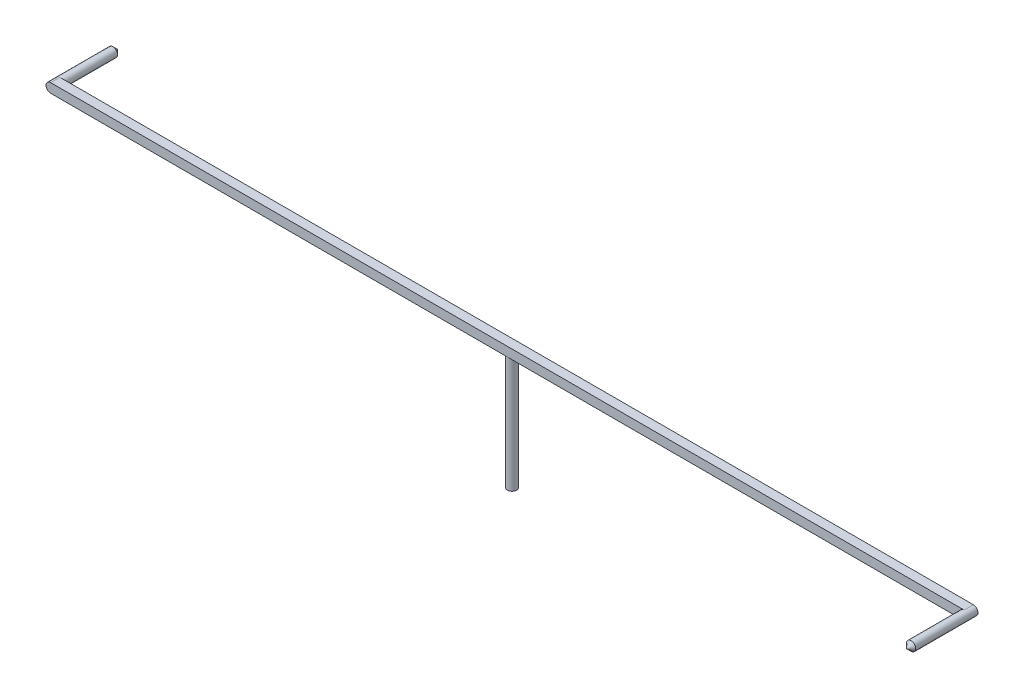
ISO-10303-21;
HEADER;
FILE_DESCRIPTION(('STEP AP214'),'2;1');
FILE_NAME('part.step','',(''),(''),'','','');
FILE_SCHEMA(('AUTOMOTIVE_DESIGN { 1 0 10303 214 1 1 1 1 }'));
ENDSEC;
DATA;
#1=APPLICATION_CONTEXT('core data for automotive mechanical design processes');
#2=APPLICATION_PROTOCOL_DEFINITION('international standard','automotive_design',2000,#1);
#3=PRODUCT_CONTEXT('',#1,'mechanical');
#4=PRODUCT('Part','Part','',(#3));
#5=PRODUCT_RELATED_PRODUCT_CATEGORY('part','',(#4));
#6=PRODUCT_DEFINITION_FORMATION('','',#4);
#7=PRODUCT_DEFINITION_CONTEXT('part definition',#1,'design');
#8=PRODUCT_DEFINITION('design','',#6,#7);
#9=PRODUCT_DEFINITION_SHAPE('','',#8);
#10=(LENGTH_UNIT() NAMED_UNIT(*) SI_UNIT(.MILLI.,.METRE.));
#11=(NAMED_UNIT(*) PLANE_ANGLE_UNIT() SI_UNIT($,.RADIAN.));
#12=(NAMED_UNIT(*) SI_UNIT($,.STERADIAN.) SOLID_ANGLE_UNIT());
#13=UNCERTAINTY_MEASURE_WITH_UNIT(LENGTH_MEASURE(1.E-05),#10,'distance_accuracy_value','');
#14=(GEOMETRIC_REPRESENTATION_CONTEXT(3) GLOBAL_UNCERTAINTY_ASSIGNED_CONTEXT((#13)) GLOBAL_UNIT_ASSIGNED_CONTEXT((#10,
#11,#12)) REPRESENTATION_CONTEXT('',''));
#15=CARTESIAN_POINT('',(0.,0.,0.));
#16=DIRECTION('',(0.,0.,1.));
#17=DIRECTION('',(1.,0.,0.));
#18=AXIS2_PLACEMENT_3D('',#15,#16,#17);
#19=CARTESIAN_POINT('',(0.,10.,0.));
#20=DIRECTION('',(0.,-1.,0.));
#21=DIRECTION('',(0.,0.,-1.));
#22=AXIS2_PLACEMENT_3D('',#19,#20,#21);
#23=CYLINDRICAL_SURFACE('',#22,0.4);
#24=CARTESIAN_POINT('',(0.,10.,0.));
#25=DIRECTION('',(0.,1.,0.));
#26=DIRECTION('',(0.,0.,1.));
#27=AXIS2_PLACEMENT_3D('',#24,#25,#26);
#28=CIRCLE('',#27,0.4);
#29=CARTESIAN_POINT('',(0.,10.,0.4));
#30=VERTEX_POINT('',#29);
#31=CARTESIAN_POINT('',(0.,10.,-0.4));
#32=VERTEX_POINT('',#31);
#33=EDGE_CURVE('E164',#30,#32,#28,.T.);
#34=ORIENTED_EDGE('',*,*,#33,.F.);
#35=EDGE_CURVE('E167',#32,#30,#28,.T.);
#36=ORIENTED_EDGE('',*,*,#35,.F.);
#37=EDGE_LOOP('',(#34,#36));
#38=FACE_BOUND('',#37,.T.);
#39=CARTESIAN_POINT('',(0.,0.,0.));
#40=DIRECTION('',(0.,1.,0.));
#41=DIRECTION('',(0.,0.,1.));
#42=AXIS2_PLACEMENT_3D('',#39,#40,#41);
#43=CIRCLE('',#42,0.4);
#44=CARTESIAN_POINT('',(0.,0.,0.4));
#45=VERTEX_POINT('',#44);
#46=EDGE_CURVE('E153',#45,#45,#43,.T.);
#47=ORIENTED_EDGE('',*,*,#46,.T.);
#48=EDGE_LOOP('',(#47));
#49=FACE_BOUND('',#48,.T.);
#50=ADVANCED_FACE('F35',(#38,#49),#23,.T.);
#51=CARTESIAN_POINT('',(0.,0.,0.));
#52=DIRECTION('',(0.,1.,0.));
#53=DIRECTION('',(0.,0.,1.));
#54=AXIS2_PLACEMENT_3D('',#51,#52,#53);
#55=PLANE('',#54);
#56=ORIENTED_EDGE('',*,*,#46,.F.);
#57=EDGE_LOOP('',(#56));
#58=FACE_BOUND('',#57,.T.);
#59=ADVANCED_FACE('F77',(#58),#55,.F.);
#60=CARTESIAN_POINT('',(0.,10.,0.));
#61=DIRECTION('',(0.,1.,0.));
#62=DIRECTION('',(0.,0.,1.));
#63=AXIS2_PLACEMENT_3D('',#60,#61,#62);
#64=PLANE('',#63);
#65=DIRECTION('',(-1.,0.,0.));
#66=VECTOR('',#65,1.);
#67=CARTESIAN_POINT('',(-40.,10.,-0.4));
#68=LINE('',#67,#66);
#69=CARTESIAN_POINT('',(39.6,10.,-0.4));
#70=VERTEX_POINT('',#69);
#71=EDGE_CURVE('E151',#70,#32,#68,.T.);
#72=ORIENTED_EDGE('',*,*,#71,.F.);
#73=DIRECTION('',(0.,0.,-1.));
#74=VECTOR('',#73,1.);
#75=CARTESIAN_POINT('',(39.6,10.,0.));
#76=LINE('',#75,#74);
#77=CARTESIAN_POINT('',(39.6,10.,0.4));
#78=VERTEX_POINT('',#77);
#79=EDGE_CURVE('E119',#70,#78,#76,.F.);
#80=ORIENTED_EDGE('',*,*,#79,.T.);
#81=DIRECTION('',(1.,0.,0.));
#82=VECTOR('',#81,1.);
#83=CARTESIAN_POINT('',(-40.,10.,0.4));
#84=LINE('',#83,#82);
#85=EDGE_CURVE('E128',#30,#78,#84,.T.);
#86=ORIENTED_EDGE('',*,*,#85,.F.);
#87=ORIENTED_EDGE('',*,*,#33,.T.);
#88=EDGE_LOOP('',(#72,#80,#86,#87));
#89=FACE_BOUND('',#88,.T.);
#90=ADVANCED_FACE('F83',(#89),#64,.F.);
#91=CARTESIAN_POINT('',(-39.6,10.,0.4));
#92=VERTEX_POINT('',#91);
#93=EDGE_CURVE('E161',#92,#30,#84,.T.);
#94=ORIENTED_EDGE('',*,*,#93,.F.);
#95=DIRECTION('',(0.,0.,1.));
#96=VECTOR('',#95,1.);
#97=CARTESIAN_POINT('',(-39.6,10.,0.));
#98=LINE('',#97,#96);
#99=CARTESIAN_POINT('',(-39.6,10.,-0.4));
#100=VERTEX_POINT('',#99);
#101=EDGE_CURVE('E173',#92,#100,#98,.F.);
#102=ORIENTED_EDGE('',*,*,#101,.T.);
#103=EDGE_CURVE('E156',#32,#100,#68,.T.);
#104=ORIENTED_EDGE('',*,*,#103,.F.);
#105=ORIENTED_EDGE('',*,*,#35,.T.);
#106=EDGE_LOOP('',(#94,#102,#104,#105));
#107=FACE_BOUND('',#106,.T.);
#108=ADVANCED_FACE('F179',(#107),#64,.F.);
#109=CARTESIAN_POINT('',(-40.,10.8,0.4));
#110=DIRECTION('',(0.,0.,-1.));
#111=DIRECTION('',(-1.,0.,0.));
#112=AXIS2_PLACEMENT_3D('',#109,#110,#111);
#113=PLANE('',#112);
#114=CARTESIAN_POINT('',(39.6,10.4,0.4));
#115=DIRECTION('',(0.,0.,1.));
#116=DIRECTION('',(1.,0.,0.));
#117=AXIS2_PLACEMENT_3D('',#114,#115,#116);
#118=CIRCLE('',#117,0.399999999999998);
#119=CARTESIAN_POINT('',(39.6,10.8,0.4));
#120=VERTEX_POINT('',#119);
#121=EDGE_CURVE('E108',#120,#78,#118,.T.);
#122=ORIENTED_EDGE('',*,*,#121,.F.);
#123=DIRECTION('',(1.,0.,0.));
#124=VECTOR('',#123,1.);
#125=CARTESIAN_POINT('',(-40.,10.8,0.4));
#126=LINE('',#125,#124);
#127=CARTESIAN_POINT('',(-39.6,10.8,0.4));
#128=VERTEX_POINT('',#127);
#129=EDGE_CURVE('E144',#128,#120,#126,.T.);
#130=ORIENTED_EDGE('',*,*,#129,.F.);
#131=CARTESIAN_POINT('',(-39.6,10.4,0.4));
#132=DIRECTION('',(0.,0.,-1.));
#133=DIRECTION('',(-1.,0.,0.));
#134=AXIS2_PLACEMENT_3D('',#131,#132,#133);
#135=CIRCLE('',#134,0.4);
#136=CARTESIAN_POINT('',(-40.,10.4,0.4));
#137=VERTEX_POINT('',#136);
#138=EDGE_CURVE('E142',#128,#137,#135,.F.);
#139=ORIENTED_EDGE('',*,*,#138,.T.);
#140=CARTESIAN_POINT('',(-39.6,10.4,0.4));
#141=DIRECTION('',(0.,0.,-1.));
#142=DIRECTION('',(-1.,0.,0.));
#143=AXIS2_PLACEMENT_3D('',#140,#141,#142);
#144=CIRCLE('',#143,0.4);
#145=EDGE_CURVE('E171',#137,#92,#144,.F.);
#146=ORIENTED_EDGE('',*,*,#145,.T.);
#147=ORIENTED_EDGE('',*,*,#93,.T.);
#148=ORIENTED_EDGE('',*,*,#85,.T.);
#149=EDGE_LOOP('',(#122,#130,#139,#146,#147,#148));
#150=FACE_BOUND('',#149,.T.);
#151=ADVANCED_FACE('F148',(#150),#113,.F.);
#152=CARTESIAN_POINT('',(-40.,10.8,-0.4));
#153=DIRECTION('',(0.,0.,1.));
#154=DIRECTION('',(1.,0.,0.));
#155=AXIS2_PLACEMENT_3D('',#152,#153,#154);
#156=PLANE('',#155);
#157=CARTESIAN_POINT('',(-39.6,10.4,-0.4));
#158=DIRECTION('',(0.,0.,-1.));
#159=DIRECTION('',(-1.,0.,0.));
#160=AXIS2_PLACEMENT_3D('',#157,#158,#159);
#161=CIRCLE('',#160,0.399999999999998);
#162=CARTESIAN_POINT('',(-39.6,10.8,-0.4));
#163=VERTEX_POINT('',#162);
#164=EDGE_CURVE('E139',#163,#100,#161,.T.);
#165=ORIENTED_EDGE('',*,*,#164,.F.);
#166=DIRECTION('',(-1.,0.,0.));
#167=VECTOR('',#166,1.);
#168=CARTESIAN_POINT('',(-40.,10.8,-0.4));
#169=LINE('',#168,#167);
#170=CARTESIAN_POINT('',(39.6,10.8,-0.4));
#171=VERTEX_POINT('',#170);
#172=EDGE_CURVE('E145',#171,#163,#169,.T.);
#173=ORIENTED_EDGE('',*,*,#172,.F.);
#174=CARTESIAN_POINT('',(39.6,10.4,-0.4));
#175=DIRECTION('',(0.,0.,1.));
#176=DIRECTION('',(1.,0.,0.));
#177=AXIS2_PLACEMENT_3D('',#174,#175,#176);
#178=CIRCLE('',#177,0.4);
#179=CARTESIAN_POINT('',(40.,10.4,-0.4));
#180=VERTEX_POINT('',#179);
#181=EDGE_CURVE('E52',#171,#180,#178,.F.);
#182=ORIENTED_EDGE('',*,*,#181,.T.);
#183=CARTESIAN_POINT('',(39.6,10.4,-0.4));
#184=DIRECTION('',(0.,0.,1.));
#185=DIRECTION('',(1.,0.,0.));
#186=AXIS2_PLACEMENT_3D('',#183,#184,#185);
#187=CIRCLE('',#186,0.4);
#188=EDGE_CURVE('E116',#180,#70,#187,.F.);
#189=ORIENTED_EDGE('',*,*,#188,.T.);
#190=ORIENTED_EDGE('',*,*,#71,.T.);
#191=ORIENTED_EDGE('',*,*,#103,.T.);
#192=EDGE_LOOP('',(#165,#173,#182,#189,#190,#191));
#193=FACE_BOUND('',#192,.T.);
#194=ADVANCED_FACE('F186',(#193),#156,.F.);
#195=CARTESIAN_POINT('',(0.,10.8,0.));
#196=DIRECTION('',(0.,1.,0.));
#197=DIRECTION('',(0.,0.,1.));
#198=AXIS2_PLACEMENT_3D('',#195,#196,#197);
#199=PLANE('',#198);
#200=ORIENTED_EDGE('',*,*,#172,.T.);
#201=DIRECTION('',(0.,0.,1.));
#202=VECTOR('',#201,1.);
#203=CARTESIAN_POINT('',(-39.6,10.8,0.4));
#204=LINE('',#203,#202);
#205=EDGE_CURVE('E115',#163,#128,#204,.T.);
#206=ORIENTED_EDGE('',*,*,#205,.T.);
#207=ORIENTED_EDGE('',*,*,#129,.T.);
#208=DIRECTION('',(0.,0.,-1.));
#209=VECTOR('',#208,1.);
#210=CARTESIAN_POINT('',(39.6,10.8,-0.4));
#211=LINE('',#210,#209);
#212=EDGE_CURVE('E104',#120,#171,#211,.T.);
#213=ORIENTED_EDGE('',*,*,#212,.T.);
#214=EDGE_LOOP('',(#200,#206,#207,#213));
#215=FACE_BOUND('',#214,.T.);
#216=ADVANCED_FACE('F93',(#215),#199,.T.);
#217=CARTESIAN_POINT('',(-39.6,10.4,0.));
#218=DIRECTION('',(0.,0.,-1.));
#219=DIRECTION('',(-1.,0.,0.));
#220=AXIS2_PLACEMENT_3D('',#217,#218,#219);
#221=CYLINDRICAL_SURFACE('',#220,0.4);
#222=CARTESIAN_POINT('',(-39.6,10.4,-4.99999999999999));
#223=DIRECTION('',(0.,0.,-1.));
#224=DIRECTION('',(-1.,0.,0.));
#225=AXIS2_PLACEMENT_3D('',#222,#223,#224);
#226=CIRCLE('',#225,0.4);
#227=CARTESIAN_POINT('',(-40.,10.4,-4.99999999999999));
#228=VERTEX_POINT('',#227);
#229=EDGE_CURVE('E44',#228,#228,#226,.F.);
#230=ORIENTED_EDGE('',*,*,#229,.T.);
#231=EDGE_LOOP('',(#230));
#232=FACE_BOUND('',#231,.T.);
#233=ORIENTED_EDGE('',*,*,#205,.F.);
#234=ORIENTED_EDGE('',*,*,#164,.T.);
#235=ORIENTED_EDGE('',*,*,#101,.F.);
#236=ORIENTED_EDGE('',*,*,#145,.F.);
#237=DIRECTION('',(0.,0.,1.));
#238=VECTOR('',#237,1.);
#239=CARTESIAN_POINT('',(-40.,10.4,-0.4));
#240=LINE('',#239,#238);
#241=CARTESIAN_POINT('',(-40.,10.4,-0.4));
#242=VERTEX_POINT('',#241);
#243=EDGE_CURVE('E126',#137,#242,#240,.F.);
#244=ORIENTED_EDGE('',*,*,#243,.T.);
#245=ORIENTED_EDGE('',*,*,#243,.F.);
#246=ORIENTED_EDGE('',*,*,#138,.F.);
#247=EDGE_LOOP('',(#233,#234,#235,#236,#244,#245,#246));
#248=FACE_BOUND('',#247,.T.);
#249=ADVANCED_FACE('F90',(#232,#248),#221,.T.);
#250=CARTESIAN_POINT('',(39.6,10.4,0.));
#251=DIRECTION('',(0.,0.,1.));
#252=DIRECTION('',(1.,0.,0.));
#253=AXIS2_PLACEMENT_3D('',#250,#251,#252);
#254=CYLINDRICAL_SURFACE('',#253,0.4);
#255=CARTESIAN_POINT('',(39.6,10.4,4.99999999999999));
#256=DIRECTION('',(0.,0.,1.));
#257=DIRECTION('',(1.,0.,0.));
#258=AXIS2_PLACEMENT_3D('',#255,#256,#257);
#259=CIRCLE('',#258,0.4);
#260=CARTESIAN_POINT('',(40.,10.4,4.99999999999999));
#261=VERTEX_POINT('',#260);
#262=EDGE_CURVE('E11',#261,#261,#259,.F.);
#263=ORIENTED_EDGE('',*,*,#262,.T.);
#264=EDGE_LOOP('',(#263));
#265=FACE_BOUND('',#264,.T.);
#266=ORIENTED_EDGE('',*,*,#212,.F.);
#267=ORIENTED_EDGE('',*,*,#121,.T.);
#268=ORIENTED_EDGE('',*,*,#79,.F.);
#269=ORIENTED_EDGE('',*,*,#188,.F.);
#270=DIRECTION('',(0.,0.,-1.));
#271=VECTOR('',#270,1.);
#272=CARTESIAN_POINT('',(40.,10.4,0.4));
#273=LINE('',#272,#271);
#274=CARTESIAN_POINT('',(40.,10.4,0.4));
#275=VERTEX_POINT('',#274);
#276=EDGE_CURVE('E129',#180,#275,#273,.F.);
#277=ORIENTED_EDGE('',*,*,#276,.T.);
#278=ORIENTED_EDGE('',*,*,#276,.F.);
#279=ORIENTED_EDGE('',*,*,#181,.F.);
#280=EDGE_LOOP('',(#266,#267,#268,#269,#277,#278,#279));
#281=FACE_BOUND('',#280,.T.);
#282=ADVANCED_FACE('F73',(#265,#281),#254,.T.);
#283=CARTESIAN_POINT('',(-39.6,10.4,-4.99999999999999));
#284=DIRECTION('',(0.,0.,1.));
#285=DIRECTION('',(1.,0.,0.));
#286=AXIS2_PLACEMENT_3D('',#283,#284,#285);
#287=CONICAL_SURFACE('',#286,0.400000000000005,0.785398163397447);
#288=ORIENTED_EDGE('',*,*,#229,.F.);
#289=EDGE_LOOP('',(#288));
#290=FACE_BOUND('',#289,.T.);
#291=CARTESIAN_POINT('',(-39.6,10.4,-5.4));
#292=VERTEX_POINT('',#291);
#293=VERTEX_LOOP('',#292);
#294=FACE_BOUND('',#293,.T.);
#295=ADVANCED_FACE('F68',(#290,#294),#287,.T.);
#296=CARTESIAN_POINT('',(39.6,10.4,4.99999999999999));
#297=DIRECTION('',(0.,0.,-1.));
#298=DIRECTION('',(-1.,0.,0.));
#299=AXIS2_PLACEMENT_3D('',#296,#297,#298);
#300=CONICAL_SURFACE('',#299,0.400000000000005,0.785398163397447);
#301=ORIENTED_EDGE('',*,*,#262,.F.);
#302=EDGE_LOOP('',(#301));
#303=FACE_BOUND('',#302,.T.);
#304=CARTESIAN_POINT('',(39.6,10.4,5.4));
#305=VERTEX_POINT('',#304);
#306=VERTEX_LOOP('',#305);
#307=FACE_BOUND('',#306,.T.);
#308=ADVANCED_FACE('F37',(#303,#307),#300,.T.);
#309=CLOSED_SHELL('',(#50,#59,#90,#108,#151,#194,#216,#249,#282,#295,#308));
#310=MANIFOLD_SOLID_BREP('B2',#309);
#311=ADVANCED_BREP_SHAPE_REPRESENTATION('',(#18,#310),#14);
#312=SHAPE_DEFINITION_REPRESENTATION(#9,#311);
ENDSEC;
END-ISO-10303-21;
